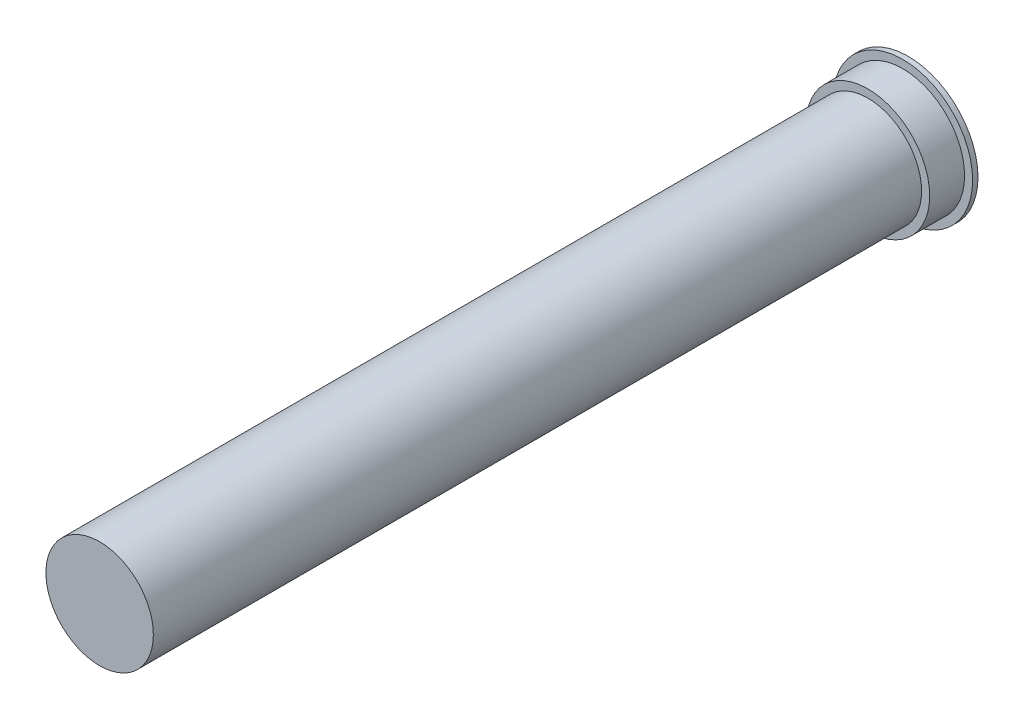
ISO-10303-21;
HEADER;
FILE_DESCRIPTION(('STEP AP214'),'2;1');
FILE_NAME('part.step','',(''),(''),'','','');
FILE_SCHEMA(('AUTOMOTIVE_DESIGN { 1 0 10303 214 1 1 1 1 }'));
ENDSEC;
DATA;
#1=APPLICATION_CONTEXT('core data for automotive mechanical design processes');
#2=APPLICATION_PROTOCOL_DEFINITION('international standard','automotive_design',2000,#1);
#3=PRODUCT_CONTEXT('',#1,'mechanical');
#4=PRODUCT('Part','Part','',(#3));
#5=PRODUCT_RELATED_PRODUCT_CATEGORY('part','',(#4));
#6=PRODUCT_DEFINITION_FORMATION('','',#4);
#7=PRODUCT_DEFINITION_CONTEXT('part definition',#1,'design');
#8=PRODUCT_DEFINITION('design','',#6,#7);
#9=PRODUCT_DEFINITION_SHAPE('','',#8);
#10=(LENGTH_UNIT() NAMED_UNIT(*) SI_UNIT(.MILLI.,.METRE.));
#11=(NAMED_UNIT(*) PLANE_ANGLE_UNIT() SI_UNIT($,.RADIAN.));
#12=(NAMED_UNIT(*) SI_UNIT($,.STERADIAN.) SOLID_ANGLE_UNIT());
#13=UNCERTAINTY_MEASURE_WITH_UNIT(LENGTH_MEASURE(1.E-05),#10,'distance_accuracy_value','');
#14=(GEOMETRIC_REPRESENTATION_CONTEXT(3) GLOBAL_UNCERTAINTY_ASSIGNED_CONTEXT((#13)) GLOBAL_UNIT_ASSIGNED_CONTEXT((#10,
#11,#12)) REPRESENTATION_CONTEXT('',''));
#15=CARTESIAN_POINT('',(0.,0.,0.));
#16=DIRECTION('',(0.,0.,1.));
#17=DIRECTION('',(1.,0.,0.));
#18=AXIS2_PLACEMENT_3D('',#15,#16,#17);
#19=CARTESIAN_POINT('',(0.,0.,15.));
#20=DIRECTION('',(0.,0.,-1.));
#21=DIRECTION('',(-1.,0.,0.));
#22=AXIS2_PLACEMENT_3D('',#19,#20,#21);
#23=CYLINDRICAL_SURFACE('',#22,23.);
#24=CARTESIAN_POINT('',(0.,0.,2.));
#25=DIRECTION('',(0.,0.,1.));
#26=DIRECTION('',(1.,0.,0.));
#27=AXIS2_PLACEMENT_3D('',#24,#25,#26);
#28=CIRCLE('',#27,23.);
#29=CARTESIAN_POINT('',(23.,0.,2.));
#30=VERTEX_POINT('',#29);
#31=EDGE_CURVE('E72',#30,#30,#28,.T.);
#32=ORIENTED_EDGE('',*,*,#31,.T.);
#33=EDGE_LOOP('',(#32));
#34=FACE_BOUND('',#33,.T.);
#35=CARTESIAN_POINT('',(0.,0.,15.));
#36=DIRECTION('',(0.,0.,1.));
#37=DIRECTION('',(1.,0.,0.));
#38=AXIS2_PLACEMENT_3D('',#35,#36,#37);
#39=CIRCLE('',#38,23.);
#40=CARTESIAN_POINT('',(23.,0.,15.));
#41=VERTEX_POINT('',#40);
#42=EDGE_CURVE('E57',#41,#41,#39,.T.);
#43=ORIENTED_EDGE('',*,*,#42,.F.);
#44=EDGE_LOOP('',(#43));
#45=FACE_BOUND('',#44,.T.);
#46=ADVANCED_FACE('F39',(#34,#45),#23,.T.);
#47=CARTESIAN_POINT('',(0.,0.,15.));
#48=DIRECTION('',(0.,0.,1.));
#49=DIRECTION('',(1.,0.,0.));
#50=AXIS2_PLACEMENT_3D('',#47,#48,#49);
#51=PLANE('',#50);
#52=CARTESIAN_POINT('',(0.,0.,15.));
#53=DIRECTION('',(0.,0.,1.));
#54=DIRECTION('',(1.,0.,0.));
#55=AXIS2_PLACEMENT_3D('',#52,#53,#54);
#56=CIRCLE('',#55,20.);
#57=CARTESIAN_POINT('',(20.,0.,15.));
#58=VERTEX_POINT('',#57);
#59=EDGE_CURVE('E63',#58,#58,#56,.T.);
#60=ORIENTED_EDGE('',*,*,#59,.F.);
#61=EDGE_LOOP('',(#60));
#62=FACE_BOUND('',#61,.T.);
#63=ORIENTED_EDGE('',*,*,#42,.T.);
#64=EDGE_LOOP('',(#63));
#65=FACE_BOUND('',#64,.T.);
#66=ADVANCED_FACE('F104',(#62,#65),#51,.T.);
#67=CARTESIAN_POINT('',(0.,0.,301.));
#68=DIRECTION('',(0.,0.,1.));
#69=DIRECTION('',(1.,0.,0.));
#70=AXIS2_PLACEMENT_3D('',#67,#68,#69);
#71=PLANE('',#70);
#72=CARTESIAN_POINT('',(0.,0.,301.));
#73=DIRECTION('',(0.,0.,1.));
#74=DIRECTION('',(1.,0.,0.));
#75=AXIS2_PLACEMENT_3D('',#72,#73,#74);
#76=CIRCLE('',#75,20.);
#77=CARTESIAN_POINT('',(20.,0.,301.));
#78=VERTEX_POINT('',#77);
#79=EDGE_CURVE('E52',#78,#78,#76,.T.);
#80=ORIENTED_EDGE('',*,*,#79,.T.);
#81=EDGE_LOOP('',(#80));
#82=FACE_BOUND('',#81,.T.);
#83=ADVANCED_FACE('F109',(#82),#71,.T.);
#84=CARTESIAN_POINT('',(0.,0.,300.));
#85=DIRECTION('',(0.,0.,-1.));
#86=DIRECTION('',(-1.,0.,0.));
#87=AXIS2_PLACEMENT_3D('',#84,#85,#86);
#88=CYLINDRICAL_SURFACE('',#87,20.);
#89=ORIENTED_EDGE('',*,*,#59,.T.);
#90=EDGE_LOOP('',(#89));
#91=FACE_BOUND('',#90,.T.);
#92=ORIENTED_EDGE('',*,*,#79,.F.);
#93=EDGE_LOOP('',(#92));
#94=FACE_BOUND('',#93,.T.);
#95=ADVANCED_FACE('F92',(#91,#94),#88,.T.);
#96=CARTESIAN_POINT('',(0.,0.,2.));
#97=DIRECTION('',(0.,0.,-1.));
#98=DIRECTION('',(-1.,0.,0.));
#99=AXIS2_PLACEMENT_3D('',#96,#97,#98);
#100=CYLINDRICAL_SURFACE('',#99,26.);
#101=CARTESIAN_POINT('',(0.,0.,2.));
#102=DIRECTION('',(0.,0.,1.));
#103=DIRECTION('',(1.,0.,0.));
#104=AXIS2_PLACEMENT_3D('',#101,#102,#103);
#105=CIRCLE('',#104,26.);
#106=CARTESIAN_POINT('',(26.,0.,2.));
#107=VERTEX_POINT('',#106);
#108=EDGE_CURVE('E67',#107,#107,#105,.T.);
#109=ORIENTED_EDGE('',*,*,#108,.F.);
#110=EDGE_LOOP('',(#109));
#111=FACE_BOUND('',#110,.T.);
#112=CARTESIAN_POINT('',(0.,0.,0.));
#113=DIRECTION('',(0.,0.,1.));
#114=DIRECTION('',(1.,0.,0.));
#115=AXIS2_PLACEMENT_3D('',#112,#113,#114);
#116=CIRCLE('',#115,26.);
#117=CARTESIAN_POINT('',(26.,0.,0.));
#118=VERTEX_POINT('',#117);
#119=EDGE_CURVE('E68',#118,#118,#116,.T.);
#120=ORIENTED_EDGE('',*,*,#119,.T.);
#121=EDGE_LOOP('',(#120));
#122=FACE_BOUND('',#121,.T.);
#123=ADVANCED_FACE('F86',(#111,#122),#100,.T.);
#124=CARTESIAN_POINT('',(0.,0.,2.));
#125=DIRECTION('',(0.,0.,1.));
#126=DIRECTION('',(1.,0.,0.));
#127=AXIS2_PLACEMENT_3D('',#124,#125,#126);
#128=PLANE('',#127);
#129=ORIENTED_EDGE('',*,*,#31,.F.);
#130=EDGE_LOOP('',(#129));
#131=FACE_BOUND('',#130,.T.);
#132=ORIENTED_EDGE('',*,*,#108,.T.);
#133=EDGE_LOOP('',(#132));
#134=FACE_BOUND('',#133,.T.);
#135=ADVANCED_FACE('F82',(#131,#134),#128,.T.);
#136=CARTESIAN_POINT('',(0.,0.,300.));
#137=DIRECTION('',(0.,0.,1.));
#138=DIRECTION('',(1.,0.,0.));
#139=AXIS2_PLACEMENT_3D('',#136,#137,#138);
#140=PLANE('',#139);
#141=CARTESIAN_POINT('',(0.,0.,300.));
#142=DIRECTION('',(0.,0.,1.));
#143=DIRECTION('',(1.,0.,0.));
#144=AXIS2_PLACEMENT_3D('',#141,#142,#143);
#145=CIRCLE('',#144,19.);
#146=CARTESIAN_POINT('',(19.,0.,300.));
#147=VERTEX_POINT('',#146);
#148=EDGE_CURVE('E47',#147,#147,#145,.T.);
#149=ORIENTED_EDGE('',*,*,#148,.F.);
#150=EDGE_LOOP('',(#149));
#151=FACE_BOUND('',#150,.T.);
#152=ADVANCED_FACE('F85',(#151),#140,.F.);
#153=CARTESIAN_POINT('',(0.,0.,300.));
#154=DIRECTION('',(0.,0.,-1.));
#155=DIRECTION('',(-1.,0.,0.));
#156=AXIS2_PLACEMENT_3D('',#153,#154,#155);
#157=CYLINDRICAL_SURFACE('',#156,19.);
#158=ORIENTED_EDGE('',*,*,#148,.T.);
#159=EDGE_LOOP('',(#158));
#160=FACE_BOUND('',#159,.T.);
#161=CARTESIAN_POINT('',(0.,0.,0.));
#162=DIRECTION('',(0.,0.,1.));
#163=DIRECTION('',(1.,0.,0.));
#164=AXIS2_PLACEMENT_3D('',#161,#162,#163);
#165=CIRCLE('',#164,19.);
#166=CARTESIAN_POINT('',(19.,0.,0.));
#167=VERTEX_POINT('',#166);
#168=EDGE_CURVE('E10',#167,#167,#165,.T.);
#169=ORIENTED_EDGE('',*,*,#168,.F.);
#170=EDGE_LOOP('',(#169));
#171=FACE_BOUND('',#170,.T.);
#172=ADVANCED_FACE('F41',(#160,#171),#157,.F.);
#173=CARTESIAN_POINT('',(0.,0.,0.));
#174=DIRECTION('',(0.,0.,1.));
#175=DIRECTION('',(1.,0.,0.));
#176=AXIS2_PLACEMENT_3D('',#173,#174,#175);
#177=PLANE('',#176);
#178=ORIENTED_EDGE('',*,*,#168,.T.);
#179=EDGE_LOOP('',(#178));
#180=FACE_BOUND('',#179,.T.);
#181=ORIENTED_EDGE('',*,*,#119,.F.);
#182=EDGE_LOOP('',(#181));
#183=FACE_BOUND('',#182,.T.);
#184=ADVANCED_FACE('F96',(#180,#183),#177,.F.);
#185=CLOSED_SHELL('',(#46,#66,#83,#95,#123,#135,#152,#172,#184));
#186=MANIFOLD_SOLID_BREP('B2',#185);
#187=ADVANCED_BREP_SHAPE_REPRESENTATION('',(#18,#186),#14);
#188=SHAPE_DEFINITION_REPRESENTATION(#9,#187);
ENDSEC;
END-ISO-10303-21;
